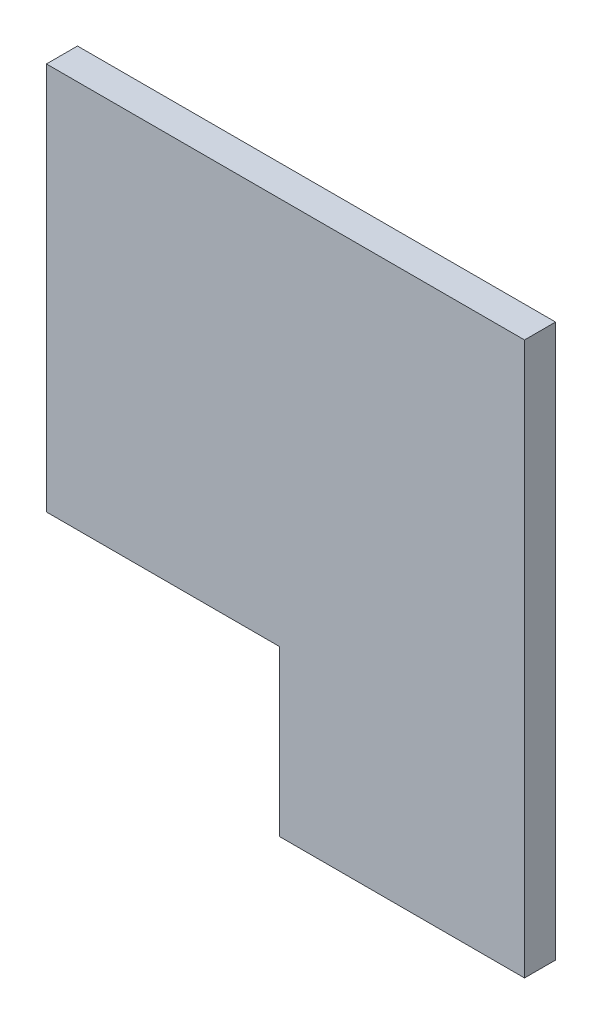
ISO-10303-21;
HEADER;
FILE_DESCRIPTION(('STEP AP214'),'2;1');
FILE_NAME('part.step','',(''),(''),'','','');
FILE_SCHEMA(('AUTOMOTIVE_DESIGN { 1 0 10303 214 1 1 1 1 }'));
ENDSEC;
DATA;
#1=APPLICATION_CONTEXT('core data for automotive mechanical design processes');
#2=APPLICATION_PROTOCOL_DEFINITION('international standard','automotive_design',2000,#1);
#3=PRODUCT_CONTEXT('',#1,'mechanical');
#4=PRODUCT('Part','Part','',(#3));
#5=PRODUCT_RELATED_PRODUCT_CATEGORY('part','',(#4));
#6=PRODUCT_DEFINITION_FORMATION('','',#4);
#7=PRODUCT_DEFINITION_CONTEXT('part definition',#1,'design');
#8=PRODUCT_DEFINITION('design','',#6,#7);
#9=PRODUCT_DEFINITION_SHAPE('','',#8);
#10=(LENGTH_UNIT() NAMED_UNIT(*) SI_UNIT(.MILLI.,.METRE.));
#11=(NAMED_UNIT(*) PLANE_ANGLE_UNIT() SI_UNIT($,.RADIAN.));
#12=(NAMED_UNIT(*) SI_UNIT($,.STERADIAN.) SOLID_ANGLE_UNIT());
#13=UNCERTAINTY_MEASURE_WITH_UNIT(LENGTH_MEASURE(1.E-05),#10,'distance_accuracy_value','');
#14=(GEOMETRIC_REPRESENTATION_CONTEXT(3) GLOBAL_UNCERTAINTY_ASSIGNED_CONTEXT((#13)) GLOBAL_UNIT_ASSIGNED_CONTEXT((#10,
#11,#12)) REPRESENTATION_CONTEXT('',''));
#15=CARTESIAN_POINT('',(0.,0.,0.));
#16=DIRECTION('',(0.,0.,1.));
#17=DIRECTION('',(1.,0.,0.));
#18=AXIS2_PLACEMENT_3D('',#15,#16,#17);
#19=CARTESIAN_POINT('',(0.,0.,-50.));
#20=DIRECTION('',(0.,0.,1.));
#21=DIRECTION('',(1.,0.,0.));
#22=AXIS2_PLACEMENT_3D('',#19,#20,#21);
#23=PLANE('',#22);
#24=DIRECTION('',(0.,-1.,0.));
#25=VECTOR('',#24,1.);
#26=CARTESIAN_POINT('',(777.,4010.,-50.));
#27=LINE('',#26,#25);
#28=CARTESIAN_POINT('',(777.,4010.,-50.));
#29=VERTEX_POINT('',#28);
#30=CARTESIAN_POINT('',(777.,3120.,-50.));
#31=VERTEX_POINT('',#30);
#32=EDGE_CURVE('E248',#29,#31,#27,.T.);
#33=ORIENTED_EDGE('',*,*,#32,.T.);
#34=DIRECTION('',(-1.,0.,0.));
#35=VECTOR('',#34,1.);
#36=CARTESIAN_POINT('',(382.,3120.,-50.));
#37=LINE('',#36,#35);
#38=CARTESIAN_POINT('',(382.,3120.,-50.));
#39=VERTEX_POINT('',#38);
#40=EDGE_CURVE('E197',#31,#39,#37,.T.);
#41=ORIENTED_EDGE('',*,*,#40,.T.);
#42=DIRECTION('',(0.,-1.,0.));
#43=VECTOR('',#42,1.);
#44=CARTESIAN_POINT('',(382.,0.,-50.));
#45=LINE('',#44,#43);
#46=CARTESIAN_POINT('',(382.,3385.,-50.));
#47=VERTEX_POINT('',#46);
#48=EDGE_CURVE('E246',#47,#39,#45,.T.);
#49=ORIENTED_EDGE('',*,*,#48,.F.);
#50=DIRECTION('',(1.,0.,0.));
#51=VECTOR('',#50,1.);
#52=CARTESIAN_POINT('',(0.,3385.,-50.));
#53=LINE('',#52,#51);
#54=CARTESIAN_POINT('',(7.00000000000008,3385.,-50.));
#55=VERTEX_POINT('',#54);
#56=EDGE_CURVE('E253',#55,#47,#53,.T.);
#57=ORIENTED_EDGE('',*,*,#56,.F.);
#58=DIRECTION('',(0.,-1.,0.));
#59=VECTOR('',#58,1.);
#60=CARTESIAN_POINT('',(7.00000000000001,4010.,-50.));
#61=LINE('',#60,#59);
#62=CARTESIAN_POINT('',(7.00000000000001,4010.,-50.));
#63=VERTEX_POINT('',#62);
#64=EDGE_CURVE('E255',#63,#55,#61,.T.);
#65=ORIENTED_EDGE('',*,*,#64,.F.);
#66=DIRECTION('',(-1.,0.,0.));
#67=VECTOR('',#66,1.);
#68=CARTESIAN_POINT('',(1999.,4010.,-50.));
#69=LINE('',#68,#67);
#70=EDGE_CURVE('E266',#29,#63,#69,.T.);
#71=ORIENTED_EDGE('',*,*,#70,.F.);
#72=EDGE_LOOP('',(#33,#41,#49,#57,#65,#71));
#73=FACE_BOUND('',#72,.T.);
#74=ADVANCED_FACE('F182',(#73),#23,.F.);
#75=CARTESIAN_POINT('',(0.,0.,0.));
#76=DIRECTION('',(0.,0.,1.));
#77=DIRECTION('',(1.,0.,0.));
#78=AXIS2_PLACEMENT_3D('',#75,#76,#77);
#79=PLANE('',#78);
#80=DIRECTION('',(-1.,0.,0.));
#81=VECTOR('',#80,1.);
#82=CARTESIAN_POINT('',(0.,3120.,0.));
#83=LINE('',#82,#81);
#84=CARTESIAN_POINT('',(777.,3120.,0.));
#85=VERTEX_POINT('',#84);
#86=CARTESIAN_POINT('',(382.,3120.,0.));
#87=VERTEX_POINT('',#86);
#88=EDGE_CURVE('E237',#85,#87,#83,.T.);
#89=ORIENTED_EDGE('',*,*,#88,.F.);
#90=DIRECTION('',(0.,-1.,0.));
#91=VECTOR('',#90,1.);
#92=CARTESIAN_POINT('',(777.,0.,0.));
#93=LINE('',#92,#91);
#94=CARTESIAN_POINT('',(777.,4010.,0.));
#95=VERTEX_POINT('',#94);
#96=EDGE_CURVE('E283',#95,#85,#93,.T.);
#97=ORIENTED_EDGE('',*,*,#96,.F.);
#98=DIRECTION('',(-1.,0.,0.));
#99=VECTOR('',#98,1.);
#100=CARTESIAN_POINT('',(1999.,4010.,0.));
#101=LINE('',#100,#99);
#102=CARTESIAN_POINT('',(7.00000000000001,4010.,0.));
#103=VERTEX_POINT('',#102);
#104=EDGE_CURVE('E265',#95,#103,#101,.T.);
#105=ORIENTED_EDGE('',*,*,#104,.T.);
#106=DIRECTION('',(0.,-1.,0.));
#107=VECTOR('',#106,1.);
#108=CARTESIAN_POINT('',(7.0000000000005,0.,0.));
#109=LINE('',#108,#107);
#110=CARTESIAN_POINT('',(7.00000000000008,3385.,0.));
#111=VERTEX_POINT('',#110);
#112=EDGE_CURVE('E190',#103,#111,#109,.T.);
#113=ORIENTED_EDGE('',*,*,#112,.T.);
#114=DIRECTION('',(1.,0.,0.));
#115=VECTOR('',#114,1.);
#116=CARTESIAN_POINT('',(0.,3385.,0.));
#117=LINE('',#116,#115);
#118=CARTESIAN_POINT('',(382.,3385.,0.));
#119=VERTEX_POINT('',#118);
#120=EDGE_CURVE('E205',#111,#119,#117,.T.);
#121=ORIENTED_EDGE('',*,*,#120,.T.);
#122=DIRECTION('',(0.,-1.,0.));
#123=VECTOR('',#122,1.);
#124=CARTESIAN_POINT('',(382.,0.,0.));
#125=LINE('',#124,#123);
#126=EDGE_CURVE('E12',#119,#87,#125,.T.);
#127=ORIENTED_EDGE('',*,*,#126,.T.);
#128=EDGE_LOOP('',(#89,#97,#105,#113,#121,#127));
#129=FACE_BOUND('',#128,.T.);
#130=ADVANCED_FACE('F271',(#129),#79,.T.);
#131=CARTESIAN_POINT('',(7.00000000000001,4010.,-50.));
#132=DIRECTION('',(-1.,0.,0.));
#133=DIRECTION('',(0.,-1.,0.));
#134=AXIS2_PLACEMENT_3D('',#131,#132,#133);
#135=PLANE('',#134);
#136=ORIENTED_EDGE('',*,*,#64,.T.);
#137=DIRECTION('',(0.,0.,1.));
#138=VECTOR('',#137,1.);
#139=CARTESIAN_POINT('',(7.00000000000008,3385.,-50.));
#140=LINE('',#139,#138);
#141=EDGE_CURVE('E278',#55,#111,#140,.T.);
#142=ORIENTED_EDGE('',*,*,#141,.T.);
#143=ORIENTED_EDGE('',*,*,#112,.F.);
#144=DIRECTION('',(0.,0.,1.));
#145=VECTOR('',#144,1.);
#146=CARTESIAN_POINT('',(7.00000000000001,4010.,-50.));
#147=LINE('',#146,#145);
#148=EDGE_CURVE('E262',#63,#103,#147,.T.);
#149=ORIENTED_EDGE('',*,*,#148,.F.);
#150=EDGE_LOOP('',(#136,#142,#143,#149));
#151=FACE_BOUND('',#150,.T.);
#152=ADVANCED_FACE('F276',(#151),#135,.T.);
#153=CARTESIAN_POINT('',(1999.,4010.,-50.));
#154=DIRECTION('',(0.,1.,0.));
#155=DIRECTION('',(0.,0.,1.));
#156=AXIS2_PLACEMENT_3D('',#153,#154,#155);
#157=PLANE('',#156);
#158=DIRECTION('',(0.,0.,1.));
#159=VECTOR('',#158,1.);
#160=CARTESIAN_POINT('',(777.,4010.,-50.));
#161=LINE('',#160,#159);
#162=EDGE_CURVE('E281',#29,#95,#161,.T.);
#163=ORIENTED_EDGE('',*,*,#162,.F.);
#164=ORIENTED_EDGE('',*,*,#70,.T.);
#165=ORIENTED_EDGE('',*,*,#148,.T.);
#166=ORIENTED_EDGE('',*,*,#104,.F.);
#167=EDGE_LOOP('',(#163,#164,#165,#166));
#168=FACE_BOUND('',#167,.T.);
#169=ADVANCED_FACE('F184',(#168),#157,.T.);
#170=CARTESIAN_POINT('',(382.,0.,-50.));
#171=DIRECTION('',(-1.,0.,0.));
#172=DIRECTION('',(0.,-1.,0.));
#173=AXIS2_PLACEMENT_3D('',#170,#171,#172);
#174=PLANE('',#173);
#175=DIRECTION('',(0.,0.,1.));
#176=VECTOR('',#175,1.);
#177=CARTESIAN_POINT('',(382.,3120.,-50.));
#178=LINE('',#177,#176);
#179=EDGE_CURVE('E234',#39,#87,#178,.T.);
#180=ORIENTED_EDGE('',*,*,#179,.T.);
#181=ORIENTED_EDGE('',*,*,#126,.F.);
#182=DIRECTION('',(0.,0.,1.));
#183=VECTOR('',#182,1.);
#184=CARTESIAN_POINT('',(382.,3385.,-50.));
#185=LINE('',#184,#183);
#186=EDGE_CURVE('E252',#47,#119,#185,.T.);
#187=ORIENTED_EDGE('',*,*,#186,.F.);
#188=ORIENTED_EDGE('',*,*,#48,.T.);
#189=EDGE_LOOP('',(#180,#181,#187,#188));
#190=FACE_BOUND('',#189,.T.);
#191=ADVANCED_FACE('F251',(#190),#174,.T.);
#192=CARTESIAN_POINT('',(0.,3385.,-50.));
#193=DIRECTION('',(0.,-1.,0.));
#194=DIRECTION('',(0.,0.,-1.));
#195=AXIS2_PLACEMENT_3D('',#192,#193,#194);
#196=PLANE('',#195);
#197=ORIENTED_EDGE('',*,*,#141,.F.);
#198=ORIENTED_EDGE('',*,*,#56,.T.);
#199=ORIENTED_EDGE('',*,*,#186,.T.);
#200=ORIENTED_EDGE('',*,*,#120,.F.);
#201=EDGE_LOOP('',(#197,#198,#199,#200));
#202=FACE_BOUND('',#201,.T.);
#203=ADVANCED_FACE('F282',(#202),#196,.T.);
#204=CARTESIAN_POINT('',(777.,4010.,-50.));
#205=DIRECTION('',(-1.,0.,0.));
#206=DIRECTION('',(0.,-1.,0.));
#207=AXIS2_PLACEMENT_3D('',#204,#205,#206);
#208=PLANE('',#207);
#209=ORIENTED_EDGE('',*,*,#96,.T.);
#210=DIRECTION('',(0.,0.,1.));
#211=VECTOR('',#210,1.);
#212=CARTESIAN_POINT('',(777.,3120.,-50.));
#213=LINE('',#212,#211);
#214=EDGE_CURVE('E240',#31,#85,#213,.T.);
#215=ORIENTED_EDGE('',*,*,#214,.F.);
#216=ORIENTED_EDGE('',*,*,#32,.F.);
#217=ORIENTED_EDGE('',*,*,#162,.T.);
#218=EDGE_LOOP('',(#209,#215,#216,#217));
#219=FACE_BOUND('',#218,.T.);
#220=ADVANCED_FACE('F292',(#219),#208,.F.);
#221=CARTESIAN_POINT('',(382.,3120.,-50.));
#222=DIRECTION('',(0.,1.,0.));
#223=DIRECTION('',(0.,0.,1.));
#224=AXIS2_PLACEMENT_3D('',#221,#222,#223);
#225=PLANE('',#224);
#226=ORIENTED_EDGE('',*,*,#88,.T.);
#227=ORIENTED_EDGE('',*,*,#179,.F.);
#228=ORIENTED_EDGE('',*,*,#40,.F.);
#229=ORIENTED_EDGE('',*,*,#214,.T.);
#230=EDGE_LOOP('',(#226,#227,#228,#229));
#231=FACE_BOUND('',#230,.T.);
#232=ADVANCED_FACE('F235',(#231),#225,.F.);
#233=CLOSED_SHELL('',(#74,#130,#152,#169,#191,#203,#220,#232));
#234=MANIFOLD_SOLID_BREP('B2',#233);
#235=ADVANCED_BREP_SHAPE_REPRESENTATION('',(#18,#234),#14);
#236=SHAPE_DEFINITION_REPRESENTATION(#9,#235);
ENDSEC;
END-ISO-10303-21;
